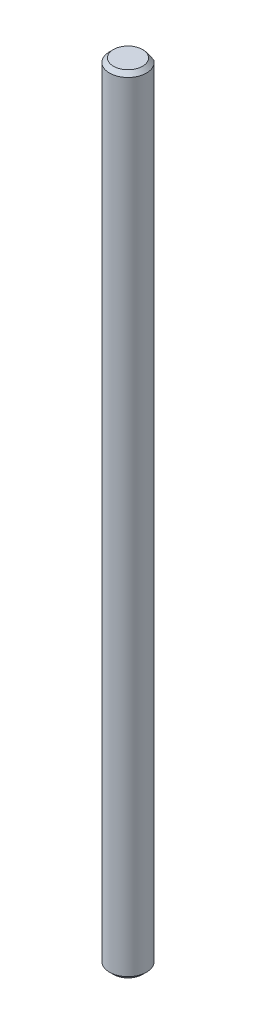
ISO-10303-21;
HEADER;
FILE_DESCRIPTION(('STEP AP214'),'2;1');
FILE_NAME('part.step','',(''),(''),'','','');
FILE_SCHEMA(('AUTOMOTIVE_DESIGN { 1 0 10303 214 1 1 1 1 }'));
ENDSEC;
DATA;
#1=APPLICATION_CONTEXT('core data for automotive mechanical design processes');
#2=APPLICATION_PROTOCOL_DEFINITION('international standard','automotive_design',2000,#1);
#3=PRODUCT_CONTEXT('',#1,'mechanical');
#4=PRODUCT('Part','Part','',(#3));
#5=PRODUCT_RELATED_PRODUCT_CATEGORY('part','',(#4));
#6=PRODUCT_DEFINITION_FORMATION('','',#4);
#7=PRODUCT_DEFINITION_CONTEXT('part definition',#1,'design');
#8=PRODUCT_DEFINITION('design','',#6,#7);
#9=PRODUCT_DEFINITION_SHAPE('','',#8);
#10=(LENGTH_UNIT() NAMED_UNIT(*) SI_UNIT(.MILLI.,.METRE.));
#11=(NAMED_UNIT(*) PLANE_ANGLE_UNIT() SI_UNIT($,.RADIAN.));
#12=(NAMED_UNIT(*) SI_UNIT($,.STERADIAN.) SOLID_ANGLE_UNIT());
#13=UNCERTAINTY_MEASURE_WITH_UNIT(LENGTH_MEASURE(1.E-05),#10,'distance_accuracy_value','');
#14=(GEOMETRIC_REPRESENTATION_CONTEXT(3) GLOBAL_UNCERTAINTY_ASSIGNED_CONTEXT((#13)) GLOBAL_UNIT_ASSIGNED_CONTEXT((#10,
#11,#12)) REPRESENTATION_CONTEXT('',''));
#15=CARTESIAN_POINT('',(0.,0.,0.));
#16=DIRECTION('',(0.,0.,1.));
#17=DIRECTION('',(1.,0.,0.));
#18=AXIS2_PLACEMENT_3D('',#15,#16,#17);
#19=CARTESIAN_POINT('',(0.,-50.,0.));
#20=DIRECTION('',(0.,-1.,0.));
#21=DIRECTION('',(1.,0.,0.));
#22=AXIS2_PLACEMENT_3D('',#19,#20,#21);
#23=PLANE('',#22);
#24=CARTESIAN_POINT('',(0.,-50.,0.));
#25=DIRECTION('',(0.,1.,0.));
#26=DIRECTION('',(-1.,0.,0.));
#27=AXIS2_PLACEMENT_3D('',#24,#25,#26);
#28=CIRCLE('',#27,1.84999999999999);
#29=CARTESIAN_POINT('',(-1.85,-50.,0.));
#30=VERTEX_POINT('',#29);
#31=EDGE_CURVE('E50',#30,#30,#28,.T.);
#32=ORIENTED_EDGE('',*,*,#31,.F.);
#33=EDGE_LOOP('',(#32));
#34=FACE_BOUND('',#33,.T.);
#35=ADVANCED_FACE('F38',(#34),#23,.T.);
#36=CARTESIAN_POINT('',(0.,-49.5,0.));
#37=DIRECTION('',(0.,1.,0.));
#38=DIRECTION('',(-1.,0.,0.));
#39=AXIS2_PLACEMENT_3D('',#36,#37,#38);
#40=CONICAL_SURFACE('',#39,2.34999999999999,0.785398163397441);
#41=CARTESIAN_POINT('',(-2.8827194899494,-48.4138725783617,-1.87000000000001));
#42=CARTESIAN_POINT('',(-2.81445428647327,-48.4711317141001,-1.87000000000001));
#43=CARTESIAN_POINT('',(-2.74590126007123,-48.5280520942552,-1.87000000000001));
#44=CARTESIAN_POINT('',(-2.60807952247293,-48.6410436644641,-1.87000000000001));
#45=CARTESIAN_POINT('',(-2.53881068862591,-48.697114704788,-1.87000000000001));
#46=CARTESIAN_POINT('',(-2.3989429011109,-48.8086129022269,-1.87000000000001));
#47=CARTESIAN_POINT('',(-2.32833797898728,-48.8640325920856,-1.87000000000001));
#48=CARTESIAN_POINT('',(-2.18611740650806,-48.9735525959807,-1.87000000000001));
#49=CARTESIAN_POINT('',(-2.11450182392652,-49.02765299783,-1.87000000000001));
#50=CARTESIAN_POINT('',(-1.96313726808899,-49.1392901539723,-1.87000000000001));
#51=CARTESIAN_POINT('',(-1.88326531218561,-49.1966609197423,-1.87000000000001));
#52=CARTESIAN_POINT('',(-1.72170571489201,-49.3087826887408,-1.87000000000001));
#53=CARTESIAN_POINT('',(-1.64001828320315,-49.3635339922574,-1.87000000000001));
#54=CARTESIAN_POINT('',(-1.47460804627272,-49.4693829839151,-1.87000000000001));
#55=CARTESIAN_POINT('',(-1.39089142970118,-49.5204902698448,-1.87000000000001));
#56=CARTESIAN_POINT('',(-1.22073452469926,-49.6179102163828,-1.87000000000001));
#57=CARTESIAN_POINT('',(-1.13429578467332,-49.6642255407325,-1.87000000000001));
#58=CARTESIAN_POINT('',(-0.973416170970021,-49.7427721266127,-1.87000000000001));
#59=CARTESIAN_POINT('',(-0.899493117845775,-49.7760530584511,-1.87000000000001));
#60=CARTESIAN_POINT('',(-0.749195678242892,-49.8366771021872,-1.87000000000001));
#61=CARTESIAN_POINT('',(-0.672820995109162,-49.8640194923699,-1.87000000000001));
#62=CARTESIAN_POINT('',(-0.51937229964853,-49.9105605300238,-1.87000000000001));
#63=CARTESIAN_POINT('',(-0.442348531331343,-49.9299214613332,-1.87000000000001));
#64=CARTESIAN_POINT('',(-0.28658996671987,-49.9597043713236,-1.87000000000001));
#65=CARTESIAN_POINT('',(-0.207856496510605,-49.9701330408318,-1.87000000000001));
#66=CARTESIAN_POINT('',(-0.0704287264566763,-49.979583622932,-1.87000000000001));
#67=CARTESIAN_POINT('',(-0.0118847967921887,-49.9808771335699,-1.87000000000001));
#68=CARTESIAN_POINT('',(0.105061112732446,-49.9779623746958,-1.87000000000001));
#69=CARTESIAN_POINT('',(0.163463109231872,-49.9737547846944,-1.87000000000001));
#70=CARTESIAN_POINT('',(0.279940604283502,-49.9600526116614,-1.87000000000001));
#71=CARTESIAN_POINT('',(0.33801282747925,-49.9505306591517,-1.87000000000001));
#72=CARTESIAN_POINT('',(0.453163087294924,-49.9267007988091,-1.87000000000001));
#73=CARTESIAN_POINT('',(0.510240878198314,-49.9123917252774,-1.87000000000001));
#74=CARTESIAN_POINT('',(0.653506340332664,-49.8708411698474,-1.87000000000001));
#75=CARTESIAN_POINT('',(0.73887485916228,-49.8407806500352,-1.87000000000001));
#76=CARTESIAN_POINT('',(0.906609555949491,-49.7732410189103,-1.87000000000001));
#77=CARTESIAN_POINT('',(0.988973396522798,-49.7357562720103,-1.87000000000001));
#78=CARTESIAN_POINT('',(1.1518866597281,-49.6548492078676,-1.87000000000001));
#79=CARTESIAN_POINT('',(1.23240416396331,-49.6113633472825,-1.87000000000001));
#80=CARTESIAN_POINT('',(1.35135864072279,-49.5430491899704,-1.87000000000001));
#81=CARTESIAN_POINT('',(1.39070036044646,-49.5197675440433,-1.87000000000001));
#82=CARTESIAN_POINT('',(1.4688371268689,-49.4723077921464,-1.87000000000001));
#83=CARTESIAN_POINT('',(1.50763220370177,-49.4481297358608,-1.87000000000001));
#84=CARTESIAN_POINT('',(1.64720743352938,-49.3591954750063,-1.87000000000001));
#85=CARTESIAN_POINT('',(1.74654909155914,-49.2921795753085,-1.87000000000001));
#86=CARTESIAN_POINT('',(1.94265251490874,-49.1544587869943,-1.87000000000001));
#87=CARTESIAN_POINT('',(2.03941347033932,-49.0837527604363,-1.87000000000001));
#88=CARTESIAN_POINT('',(2.23101539990903,-48.9396141935899,-1.87000000000001));
#89=CARTESIAN_POINT('',(2.32585451704771,-48.8661791939673,-1.87000000000001));
#90=CARTESIAN_POINT('',(2.51396875477792,-48.7173275867176,-1.87000000000001));
#91=CARTESIAN_POINT('',(2.60724376172092,-48.6419108361095,-1.87000000000001));
#92=CARTESIAN_POINT('',(2.79292478152608,-48.4892673321697,-1.87000000000001));
#93=CARTESIAN_POINT('',(2.88532581680434,-48.4120345386213,-1.87000000000001));
#94=CARTESIAN_POINT('',(3.06912727329596,-48.2563858662656,-1.87000000000001));
#95=CARTESIAN_POINT('',(3.16052767187417,-48.1779699607905,-1.87000000000001));
#96=CARTESIAN_POINT('',(3.43341646799127,-47.9414239251026,-1.87000000000001));
#97=CARTESIAN_POINT('',(3.61370069411499,-47.781905455746,-1.87000000000001));
#98=CARTESIAN_POINT('',(3.94959693526313,-47.4806212040724,-1.87000000000001));
#99=CARTESIAN_POINT('',(4.10546570618417,-47.339140007316,-1.87000000000001));
#100=CARTESIAN_POINT('',(4.41598751745907,-47.054799331058,-1.87000000000001));
#101=CARTESIAN_POINT('',(4.57064035378674,-46.9119396288458,-1.87000000000001));
#102=CARTESIAN_POINT('',(4.87780252056511,-46.6263345011237,-1.87000000000001));
#103=CARTESIAN_POINT('',(5.03031915593452,-46.4835969174529,-1.87000000000001));
#104=CARTESIAN_POINT('',(5.33459300172761,-46.197373905686,-1.87000000000001));
#105=CARTESIAN_POINT('',(5.48635035531777,-46.0538886298557,-1.87000000000001));
#106=CARTESIAN_POINT('',(5.63783984614246,-45.9101230542416,-1.87000000000001));
#107=B_SPLINE_CURVE_WITH_KNOTS('',3,(#41,#42,#43,#44,#45,#46,#47,#48,#49,#50,#51,#52,#53,#54,
#55,#56,#57,#58,#59,#60,#61,#62,#63,#64,#65,#66,#67,#68,#69,#70,#71,#72,#73,#74,#75,#76,#77,#78,
#79,#80,#81,#82,#83,#84,#85,#86,#87,#88,#89,#90,#91,#92,#93,#94,#95,#96,#97,#98,#99,#100,#101,
#102,#103,#104,#105,#106),.UNSPECIFIED.,.F.,.F.,(4,2,2,2,2,2,2,2,2,2,2,2,2,2,2,2,2,2,2,2,2,2,2,
2,2,2,2,2,2,2,2,2,4),(0.,0.267302019205972,0.53465062512815,0.803910218683023,1.07315184091427,
1.36813533063952,1.66308492280033,1.95722653483404,2.2512037517737,2.49421760834876,
2.73726098205549,2.97508476888756,3.2127302545223,3.38815686809527,3.56356181454978,
3.73987856188159,3.91623827491054,4.18725762179097,4.45848348816719,4.73284013971441,
4.86997463532886,5.00710154149208,5.36646121143795,5.72593236121501,6.08573571809293,
6.44556510604609,6.806835862097,7.16811477354969,7.89025037137209,8.52175497033717,
9.15336336242653,9.78003279458615,10.4065792398481),.UNSPECIFIED.);
#108=CARTESIAN_POINT('',(1.42323574997256,-49.5,-1.87000000000001));
#109=VERTEX_POINT('',#108);
#110=CARTESIAN_POINT('',(-1.42323574997256,-49.5,-1.87000000000001));
#111=VERTEX_POINT('',#110);
#112=EDGE_CURVE('E61',#109,#111,#107,.F.);
#113=ORIENTED_EDGE('',*,*,#112,.F.);
#114=CARTESIAN_POINT('',(0.,-49.5,0.));
#115=DIRECTION('',(0.,1.,0.));
#116=DIRECTION('',(-1.,0.,0.));
#117=AXIS2_PLACEMENT_3D('',#114,#115,#116);
#118=CIRCLE('',#117,2.34999999999999);
#119=EDGE_CURVE('E77',#111,#109,#118,.T.);
#120=ORIENTED_EDGE('',*,*,#119,.F.);
#121=EDGE_LOOP('',(#113,#120));
#122=FACE_BOUND('',#121,.T.);
#123=ORIENTED_EDGE('',*,*,#31,.T.);
#124=EDGE_LOOP('',(#123));
#125=FACE_BOUND('',#124,.T.);
#126=ADVANCED_FACE('F75',(#122,#125),#40,.T.);
#127=CARTESIAN_POINT('',(0.,50.,0.));
#128=DIRECTION('',(0.,1.,0.));
#129=DIRECTION('',(-1.,0.,0.));
#130=AXIS2_PLACEMENT_3D('',#127,#128,#129);
#131=CYLINDRICAL_SURFACE('',#130,2.34999999999999);
#132=DIRECTION('',(0.,1.,0.));
#133=VECTOR('',#132,1.);
#134=CARTESIAN_POINT('',(1.42323574997256,-50.,-1.87000000000001));
#135=LINE('',#134,#133);
#136=CARTESIAN_POINT('',(1.42323574997256,49.5,-1.87000000000001));
#137=VERTEX_POINT('',#136);
#138=EDGE_CURVE('E66',#109,#137,#135,.T.);
#139=ORIENTED_EDGE('',*,*,#138,.T.);
#140=CARTESIAN_POINT('',(0.,49.5,0.));
#141=DIRECTION('',(0.,1.,0.));
#142=DIRECTION('',(-1.,0.,0.));
#143=AXIS2_PLACEMENT_3D('',#140,#141,#142);
#144=CIRCLE('',#143,2.34999999999999);
#145=CARTESIAN_POINT('',(-1.42323574997256,49.5,-1.87));
#146=VERTEX_POINT('',#145);
#147=EDGE_CURVE('E81',#146,#137,#144,.T.);
#148=ORIENTED_EDGE('',*,*,#147,.F.);
#149=DIRECTION('',(0.,1.,0.));
#150=VECTOR('',#149,1.);
#151=CARTESIAN_POINT('',(-1.42323574997256,-50.,-1.87000000000001));
#152=LINE('',#151,#150);
#153=EDGE_CURVE('E56',#111,#146,#152,.T.);
#154=ORIENTED_EDGE('',*,*,#153,.F.);
#155=ORIENTED_EDGE('',*,*,#119,.T.);
#156=EDGE_LOOP('',(#139,#148,#154,#155));
#157=FACE_BOUND('',#156,.T.);
#158=ADVANCED_FACE('F80',(#157),#131,.T.);
#159=CARTESIAN_POINT('',(0.,50.,0.));
#160=DIRECTION('',(0.,-1.,0.));
#161=DIRECTION('',(1.,0.,0.));
#162=AXIS2_PLACEMENT_3D('',#159,#160,#161);
#163=CONICAL_SURFACE('',#162,1.85,0.785398163397429);
#164=CARTESIAN_POINT('',(-2.88271948994937,48.4138725783617,-1.87000000000001));
#165=CARTESIAN_POINT('',(-2.81445428647324,48.4711317141001,-1.87000000000001));
#166=CARTESIAN_POINT('',(-2.7459012600712,48.5280520942552,-1.87000000000001));
#167=CARTESIAN_POINT('',(-2.6080795224729,48.6410436644641,-1.87000000000001));
#168=CARTESIAN_POINT('',(-2.53881068862588,48.697114704788,-1.87000000000001));
#169=CARTESIAN_POINT('',(-2.39894290111088,48.8086129022269,-1.87000000000001));
#170=CARTESIAN_POINT('',(-2.32833797898725,48.8640325920856,-1.87000000000001));
#171=CARTESIAN_POINT('',(-2.18611740650804,48.9735525959807,-1.87000000000001));
#172=CARTESIAN_POINT('',(-2.11450182392649,49.02765299783,-1.87000000000001));
#173=CARTESIAN_POINT('',(-1.96313726808897,49.1392901539723,-1.87000000000001));
#174=CARTESIAN_POINT('',(-1.8832653121856,49.1966609197423,-1.87000000000001));
#175=CARTESIAN_POINT('',(-1.721705714892,49.3087826887408,-1.87000000000001));
#176=CARTESIAN_POINT('',(-1.64001828320314,49.3635339922575,-1.87000000000001));
#177=CARTESIAN_POINT('',(-1.47460804627272,49.4693829839151,-1.87000000000001));
#178=CARTESIAN_POINT('',(-1.39089142970118,49.5204902698448,-1.87000000000001));
#179=CARTESIAN_POINT('',(-1.22073452469926,49.6179102163828,-1.87000000000001));
#180=CARTESIAN_POINT('',(-1.13429578467332,49.6642255407325,-1.87000000000001));
#181=CARTESIAN_POINT('',(-0.973416170970018,49.7427721266127,-1.87000000000001));
#182=CARTESIAN_POINT('',(-0.899493117845775,49.7760530584511,-1.87000000000001));
#183=CARTESIAN_POINT('',(-0.7491956782429,49.8366771021872,-1.87000000000001));
#184=CARTESIAN_POINT('',(-0.672820995109176,49.86401949237,-1.87000000000001));
#185=CARTESIAN_POINT('',(-0.519372299648551,49.9105605300238,-1.87000000000001));
#186=CARTESIAN_POINT('',(-0.442348531331367,49.9299214613333,-1.87000000000001));
#187=CARTESIAN_POINT('',(-0.286589966719897,49.9597043713236,-1.87000000000001));
#188=CARTESIAN_POINT('',(-0.207856496510632,49.9701330408317,-1.87000000000001));
#189=CARTESIAN_POINT('',(-0.0704287264567043,49.979583622932,-1.87000000000001));
#190=CARTESIAN_POINT('',(-0.0118847967922182,49.9808771335699,-1.87000000000001));
#191=CARTESIAN_POINT('',(0.105061112732413,49.9779623746958,-1.87000000000001));
#192=CARTESIAN_POINT('',(0.163463109231837,49.9737547846944,-1.87000000000001));
#193=CARTESIAN_POINT('',(0.279940604283464,49.9600526116614,-1.87000000000001));
#194=CARTESIAN_POINT('',(0.338012827479212,49.9505306591517,-1.87000000000001));
#195=CARTESIAN_POINT('',(0.453163087294881,49.9267007988091,-1.87000000000001));
#196=CARTESIAN_POINT('',(0.510240878198266,49.9123917252774,-1.87000000000001));
#197=CARTESIAN_POINT('',(0.653506340332608,49.8708411698474,-1.87000000000001));
#198=CARTESIAN_POINT('',(0.738874859162223,49.8407806500353,-1.87000000000001));
#199=CARTESIAN_POINT('',(0.906609555949428,49.7732410189104,-1.87000000000001));
#200=CARTESIAN_POINT('',(0.98897339652273,49.7357562720104,-1.87000000000001));
#201=CARTESIAN_POINT('',(1.15188665972802,49.6548492078677,-1.87000000000001));
#202=CARTESIAN_POINT('',(1.23240416396322,49.6113633472826,-1.87000000000001));
#203=CARTESIAN_POINT('',(1.3513586407227,49.5430491899705,-1.87000000000001));
#204=CARTESIAN_POINT('',(1.39070036044637,49.5197675440434,-1.87000000000001));
#205=CARTESIAN_POINT('',(1.4688371268688,49.4723077921465,-1.87000000000001));
#206=CARTESIAN_POINT('',(1.50763220370166,49.4481297358609,-1.87000000000001));
#207=CARTESIAN_POINT('',(1.64720743352927,49.3591954750063,-1.87000000000001));
#208=CARTESIAN_POINT('',(1.74654909155904,49.2921795753086,-1.87000000000001));
#209=CARTESIAN_POINT('',(1.94265251490867,49.1544587869943,-1.87000000000001));
#210=CARTESIAN_POINT('',(2.03941347033924,49.0837527604364,-1.87000000000001));
#211=CARTESIAN_POINT('',(2.23101539990895,48.93961419359,-1.87000000000001));
#212=CARTESIAN_POINT('',(2.32585451704763,48.8661791939673,-1.87000000000001));
#213=CARTESIAN_POINT('',(2.51396875477784,48.7173275867176,-1.87000000000001));
#214=CARTESIAN_POINT('',(2.60724376172085,48.6419108361095,-1.87000000000001));
#215=CARTESIAN_POINT('',(2.79292478152601,48.4892673321698,-1.87000000000001));
#216=CARTESIAN_POINT('',(2.88532581680427,48.4120345386213,-1.87000000000001));
#217=CARTESIAN_POINT('',(3.06912727329589,48.2563858662656,-1.87000000000001));
#218=CARTESIAN_POINT('',(3.1605276718741,48.1779699607905,-1.87000000000001));
#219=CARTESIAN_POINT('',(3.4334164679912,47.9414239251026,-1.87000000000001));
#220=CARTESIAN_POINT('',(3.61370069411493,47.781905455746,-1.87000000000001));
#221=CARTESIAN_POINT('',(3.94959693526307,47.4806212040724,-1.87000000000001));
#222=CARTESIAN_POINT('',(4.1054657061841,47.3391400073161,-1.87000000000001));
#223=CARTESIAN_POINT('',(4.41598751745899,47.054799331058,-1.87000000000001));
#224=CARTESIAN_POINT('',(4.57064035378665,46.9119396288458,-1.87000000000001));
#225=CARTESIAN_POINT('',(4.87780252056502,46.6263345011237,-1.87000000000001));
#226=CARTESIAN_POINT('',(5.03031915593442,46.4835969174529,-1.87000000000001));
#227=CARTESIAN_POINT('',(5.3345930017275,46.197373905686,-1.87000000000001));
#228=CARTESIAN_POINT('',(5.48635035531766,46.0538886298558,-1.87000000000001));
#229=CARTESIAN_POINT('',(5.63783984614234,45.9101230542416,-1.87000000000001));
#230=B_SPLINE_CURVE_WITH_KNOTS('',3,(#164,#165,#166,#167,#168,#169,#170,#171,#172,#173,#174,
#175,#176,#177,#178,#179,#180,#181,#182,#183,#184,#185,#186,#187,#188,#189,#190,#191,#192,#193,
#194,#195,#196,#197,#198,#199,#200,#201,#202,#203,#204,#205,#206,#207,#208,#209,#210,#211,#212,
#213,#214,#215,#216,#217,#218,#219,#220,#221,#222,#223,#224,#225,#226,#227,#228,#229),
.UNSPECIFIED.,.F.,.F.,(4,2,2,2,2,2,2,2,2,2,2,2,2,2,2,2,2,2,2,2,2,2,2,2,2,2,2,2,2,2,2,2,4),(0.,
0.267302019205976,0.534650625128155,0.803910218683028,1.07315184091427,1.36813533063952,
1.66308492280032,1.95722653483402,2.25120375177369,2.49421760834875,2.73726098205546,
2.97508476888752,3.21273025452225,3.38815686809523,3.56356181454973,3.73987856188153,
3.91623827491047,4.18725762179089,4.45848348816709,4.7328401397143,4.86997463532874,
5.00710154149196,5.36646121143784,5.7259323612149,6.08573571809283,6.44556510604599,
6.80683586209691,7.1681147735496,7.89025037137202,8.5217549703371,9.15336336242644,
9.78003279458604,10.406579239848),.UNSPECIFIED.);
#231=EDGE_CURVE('E11',#146,#137,#230,.T.);
#232=ORIENTED_EDGE('',*,*,#231,.F.);
#233=ORIENTED_EDGE('',*,*,#147,.T.);
#234=EDGE_LOOP('',(#232,#233));
#235=FACE_BOUND('',#234,.T.);
#236=CARTESIAN_POINT('',(0.,50.,0.));
#237=DIRECTION('',(0.,1.,0.));
#238=DIRECTION('',(-1.,0.,0.));
#239=AXIS2_PLACEMENT_3D('',#236,#237,#238);
#240=CIRCLE('',#239,1.85);
#241=CARTESIAN_POINT('',(-1.85,50.,0.));
#242=VERTEX_POINT('',#241);
#243=EDGE_CURVE('E78',#242,#242,#240,.T.);
#244=ORIENTED_EDGE('',*,*,#243,.F.);
#245=EDGE_LOOP('',(#244));
#246=FACE_BOUND('',#245,.T.);
#247=ADVANCED_FACE('F97',(#235,#246),#163,.T.);
#248=CARTESIAN_POINT('',(-1.85,50.,0.));
#249=DIRECTION('',(0.,1.,0.));
#250=DIRECTION('',(-1.,0.,0.));
#251=AXIS2_PLACEMENT_3D('',#248,#249,#250);
#252=PLANE('',#251);
#253=ORIENTED_EDGE('',*,*,#243,.T.);
#254=EDGE_LOOP('',(#253));
#255=FACE_BOUND('',#254,.T.);
#256=ADVANCED_FACE('F100',(#255),#252,.T.);
#257=CARTESIAN_POINT('',(0.,-50.,-1.87000000000001));
#258=DIRECTION('',(0.,0.,1.));
#259=DIRECTION('',(1.,0.,0.));
#260=AXIS2_PLACEMENT_3D('',#257,#258,#259);
#261=PLANE('',#260);
#262=ORIENTED_EDGE('',*,*,#112,.T.);
#263=ORIENTED_EDGE('',*,*,#153,.T.);
#264=ORIENTED_EDGE('',*,*,#231,.T.);
#265=ORIENTED_EDGE('',*,*,#138,.F.);
#266=EDGE_LOOP('',(#262,#263,#264,#265));
#267=FACE_BOUND('',#266,.T.);
#268=ADVANCED_FACE('F67',(#267),#261,.F.);
#269=CLOSED_SHELL('',(#35,#126,#158,#247,#256,#268));
#270=MANIFOLD_SOLID_BREP('B2',#269);
#271=ADVANCED_BREP_SHAPE_REPRESENTATION('',(#18,#270),#14);
#272=SHAPE_DEFINITION_REPRESENTATION(#9,#271);
ENDSEC;
END-ISO-10303-21;
